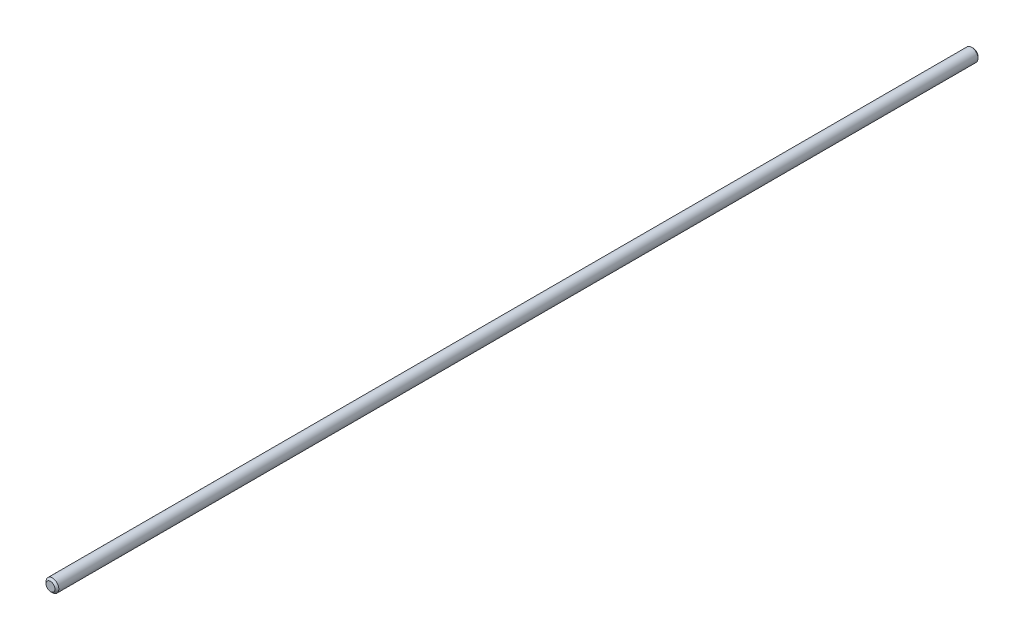
ISO-10303-21;
HEADER;
FILE_DESCRIPTION(('STEP AP214'),'2;1');
FILE_NAME('part.step','',(''),(''),'','','');
FILE_SCHEMA(('AUTOMOTIVE_DESIGN { 1 0 10303 214 1 1 1 1 }'));
ENDSEC;
DATA;
#1=APPLICATION_CONTEXT('core data for automotive mechanical design processes');
#2=APPLICATION_PROTOCOL_DEFINITION('international standard','automotive_design',2000,#1);
#3=PRODUCT_CONTEXT('',#1,'mechanical');
#4=PRODUCT('Part','Part','',(#3));
#5=PRODUCT_RELATED_PRODUCT_CATEGORY('part','',(#4));
#6=PRODUCT_DEFINITION_FORMATION('','',#4);
#7=PRODUCT_DEFINITION_CONTEXT('part definition',#1,'design');
#8=PRODUCT_DEFINITION('design','',#6,#7);
#9=PRODUCT_DEFINITION_SHAPE('','',#8);
#10=(LENGTH_UNIT() NAMED_UNIT(*) SI_UNIT(.MILLI.,.METRE.));
#11=(NAMED_UNIT(*) PLANE_ANGLE_UNIT() SI_UNIT($,.RADIAN.));
#12=(NAMED_UNIT(*) SI_UNIT($,.STERADIAN.) SOLID_ANGLE_UNIT());
#13=UNCERTAINTY_MEASURE_WITH_UNIT(LENGTH_MEASURE(1.E-05),#10,'distance_accuracy_value','');
#14=(GEOMETRIC_REPRESENTATION_CONTEXT(3) GLOBAL_UNCERTAINTY_ASSIGNED_CONTEXT((#13)) GLOBAL_UNIT_ASSIGNED_CONTEXT((#10,
#11,#12)) REPRESENTATION_CONTEXT('',''));
#15=CARTESIAN_POINT('',(0.,0.,0.));
#16=DIRECTION('',(0.,0.,1.));
#17=DIRECTION('',(1.,0.,0.));
#18=AXIS2_PLACEMENT_3D('',#15,#16,#17);
#19=CARTESIAN_POINT('',(0.,0.,228.6));
#20=DIRECTION('',(0.,0.,-1.));
#21=DIRECTION('',(-1.,0.,0.));
#22=AXIS2_PLACEMENT_3D('',#19,#20,#21);
#23=PLANE('',#22);
#24=CARTESIAN_POINT('',(0.,0.,228.6));
#25=DIRECTION('',(0.,0.,-1.));
#26=DIRECTION('',(-1.,0.,0.));
#27=AXIS2_PLACEMENT_3D('',#24,#25,#26);
#28=CIRCLE('',#27,2.22250000000007);
#29=CARTESIAN_POINT('',(-2.22250000000007,0.,228.6));
#30=VERTEX_POINT('',#29);
#31=EDGE_CURVE('E10',#30,#30,#28,.F.);
#32=ORIENTED_EDGE('',*,*,#31,.T.);
#33=EDGE_LOOP('',(#32));
#34=FACE_BOUND('',#33,.T.);
#35=ADVANCED_FACE('F43',(#34),#23,.F.);
#36=CARTESIAN_POINT('',(0.,0.,228.6));
#37=DIRECTION('',(0.,0.,1.));
#38=DIRECTION('',(1.,0.,0.));
#39=AXIS2_PLACEMENT_3D('',#36,#37,#38);
#40=CYLINDRICAL_SURFACE('',#39,3.17500000000008);
#41=CARTESIAN_POINT('',(0.,0.,-227.6475));
#42=DIRECTION('',(0.,0.,1.));
#43=DIRECTION('',(1.,0.,0.));
#44=AXIS2_PLACEMENT_3D('',#41,#42,#43);
#45=CIRCLE('',#44,3.17500000000008);
#46=CARTESIAN_POINT('',(3.17500000000008,0.,-227.6475));
#47=VERTEX_POINT('',#46);
#48=EDGE_CURVE('E56',#47,#47,#45,.T.);
#49=ORIENTED_EDGE('',*,*,#48,.T.);
#50=EDGE_LOOP('',(#49));
#51=FACE_BOUND('',#50,.T.);
#52=CARTESIAN_POINT('',(0.,0.,227.6475));
#53=DIRECTION('',(0.,0.,-1.));
#54=DIRECTION('',(-1.,0.,0.));
#55=AXIS2_PLACEMENT_3D('',#52,#53,#54);
#56=CIRCLE('',#55,3.17500000000008);
#57=CARTESIAN_POINT('',(-3.17500000000008,0.,227.6475));
#58=VERTEX_POINT('',#57);
#59=EDGE_CURVE('E61',#58,#58,#56,.T.);
#60=ORIENTED_EDGE('',*,*,#59,.T.);
#61=EDGE_LOOP('',(#60));
#62=FACE_BOUND('',#61,.T.);
#63=ADVANCED_FACE('F68',(#51,#62),#40,.T.);
#64=CARTESIAN_POINT('',(0.,0.,-228.6));
#65=DIRECTION('',(0.,0.,1.));
#66=DIRECTION('',(1.,0.,0.));
#67=AXIS2_PLACEMENT_3D('',#64,#65,#66);
#68=PLANE('',#67);
#69=CARTESIAN_POINT('',(0.,0.,-228.6));
#70=DIRECTION('',(0.,0.,1.));
#71=DIRECTION('',(1.,0.,0.));
#72=AXIS2_PLACEMENT_3D('',#69,#70,#71);
#73=CIRCLE('',#72,2.22249999999999);
#74=CARTESIAN_POINT('',(2.22249999999999,0.,-228.6));
#75=VERTEX_POINT('',#74);
#76=EDGE_CURVE('E51',#75,#75,#73,.F.);
#77=ORIENTED_EDGE('',*,*,#76,.T.);
#78=EDGE_LOOP('',(#77));
#79=FACE_BOUND('',#78,.T.);
#80=ADVANCED_FACE('F76',(#79),#68,.F.);
#81=CARTESIAN_POINT('',(0.,0.,-227.6475));
#82=DIRECTION('',(0.,0.,1.));
#83=DIRECTION('',(1.,0.,0.));
#84=AXIS2_PLACEMENT_3D('',#81,#82,#83);
#85=CONICAL_SURFACE('',#84,3.17500000000008,0.785398163397472);
#86=ORIENTED_EDGE('',*,*,#76,.F.);
#87=EDGE_LOOP('',(#86));
#88=FACE_BOUND('',#87,.T.);
#89=ORIENTED_EDGE('',*,*,#48,.F.);
#90=EDGE_LOOP('',(#89));
#91=FACE_BOUND('',#90,.T.);
#92=ADVANCED_FACE('F72',(#88,#91),#85,.T.);
#93=CARTESIAN_POINT('',(0.,0.,228.6));
#94=DIRECTION('',(0.,0.,-1.));
#95=DIRECTION('',(-1.,0.,0.));
#96=AXIS2_PLACEMENT_3D('',#93,#94,#95);
#97=CONICAL_SURFACE('',#96,2.22250000000007,0.785398163397443);
#98=ORIENTED_EDGE('',*,*,#59,.F.);
#99=EDGE_LOOP('',(#98));
#100=FACE_BOUND('',#99,.T.);
#101=ORIENTED_EDGE('',*,*,#31,.F.);
#102=EDGE_LOOP('',(#101));
#103=FACE_BOUND('',#102,.T.);
#104=ADVANCED_FACE('F45',(#100,#103),#97,.T.);
#105=CLOSED_SHELL('',(#35,#63,#80,#92,#104));
#106=MANIFOLD_SOLID_BREP('B2',#105);
#107=ADVANCED_BREP_SHAPE_REPRESENTATION('',(#18,#106),#14);
#108=SHAPE_DEFINITION_REPRESENTATION(#9,#107);
ENDSEC;
END-ISO-10303-21;
